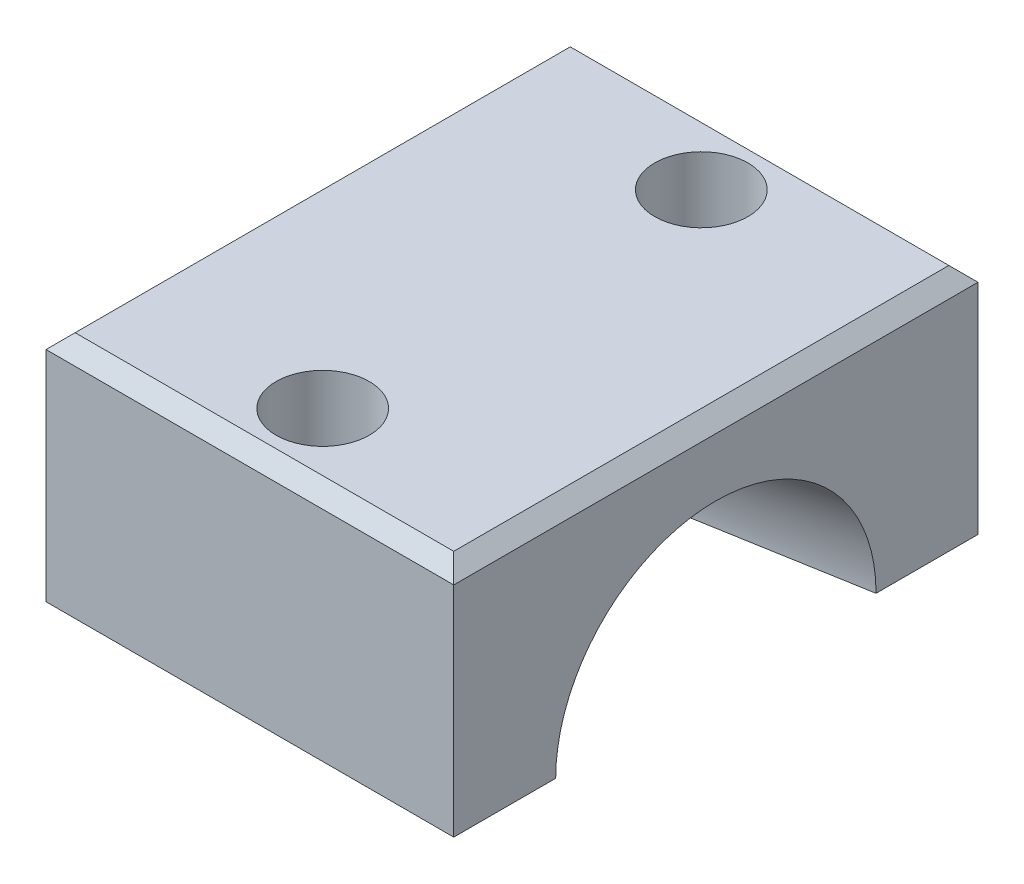
ISO-10303-21;
HEADER;
FILE_DESCRIPTION(('STEP AP214'),'2;1');
FILE_NAME('part.step','',(''),(''),'','','');
FILE_SCHEMA(('AUTOMOTIVE_DESIGN { 1 0 10303 214 1 1 1 1 }'));
ENDSEC;
DATA;
#1=APPLICATION_CONTEXT('core data for automotive mechanical design processes');
#2=APPLICATION_PROTOCOL_DEFINITION('international standard','automotive_design',2000,#1);
#3=PRODUCT_CONTEXT('',#1,'mechanical');
#4=PRODUCT('Part','Part','',(#3));
#5=PRODUCT_RELATED_PRODUCT_CATEGORY('part','',(#4));
#6=PRODUCT_DEFINITION_FORMATION('','',#4);
#7=PRODUCT_DEFINITION_CONTEXT('part definition',#1,'design');
#8=PRODUCT_DEFINITION('design','',#6,#7);
#9=PRODUCT_DEFINITION_SHAPE('','',#8);
#10=(LENGTH_UNIT() NAMED_UNIT(*) SI_UNIT(.MILLI.,.METRE.));
#11=(NAMED_UNIT(*) PLANE_ANGLE_UNIT() SI_UNIT($,.RADIAN.));
#12=(NAMED_UNIT(*) SI_UNIT($,.STERADIAN.) SOLID_ANGLE_UNIT());
#13=UNCERTAINTY_MEASURE_WITH_UNIT(LENGTH_MEASURE(1.E-05),#10,'distance_accuracy_value','');
#14=(GEOMETRIC_REPRESENTATION_CONTEXT(3) GLOBAL_UNCERTAINTY_ASSIGNED_CONTEXT((#13)) GLOBAL_UNIT_ASSIGNED_CONTEXT((#10,
#11,#12)) REPRESENTATION_CONTEXT('',''));
#15=CARTESIAN_POINT('',(0.,0.,0.));
#16=DIRECTION('',(0.,0.,1.));
#17=DIRECTION('',(1.,0.,0.));
#18=AXIS2_PLACEMENT_3D('',#15,#16,#17);
#19=CARTESIAN_POINT('',(0.,-4.,0.));
#20=DIRECTION('',(0.,-1.,0.));
#21=DIRECTION('',(0.,0.,-1.));
#22=AXIS2_PLACEMENT_3D('',#19,#20,#21);
#23=PLANE('',#22);
#24=DIRECTION('',(0.985211754819674,0.,-0.171341174751248));
#25=VECTOR('',#24,1.);
#26=CARTESIAN_POINT('',(-24.625,-4.,0.));
#27=LINE('',#26,#25);
#28=CARTESIAN_POINT('',(-4.5,-4.,-3.5));
#29=VERTEX_POINT('',#28);
#30=CARTESIAN_POINT('',(7.,-4.,-5.5));
#31=VERTEX_POINT('',#30);
#32=EDGE_CURVE('E113',#29,#31,#27,.T.);
#33=ORIENTED_EDGE('',*,*,#32,.F.);
#34=DIRECTION('',(-1.,0.,0.));
#35=VECTOR('',#34,1.);
#36=CARTESIAN_POINT('',(-4.5,-4.,-3.5));
#37=LINE('',#36,#35);
#38=CARTESIAN_POINT('',(-7.,-4.,-3.5));
#39=VERTEX_POINT('',#38);
#40=EDGE_CURVE('E290',#39,#29,#37,.F.);
#41=ORIENTED_EDGE('',*,*,#40,.F.);
#42=DIRECTION('',(0.,0.,1.));
#43=VECTOR('',#42,1.);
#44=CARTESIAN_POINT('',(-7.,-4.,9.));
#45=LINE('',#44,#43);
#46=CARTESIAN_POINT('',(-7.,-4.,-9.));
#47=VERTEX_POINT('',#46);
#48=EDGE_CURVE('E163',#47,#39,#45,.T.);
#49=ORIENTED_EDGE('',*,*,#48,.F.);
#50=DIRECTION('',(-1.,0.,0.));
#51=VECTOR('',#50,1.);
#52=CARTESIAN_POINT('',(-7.,-4.,-9.));
#53=LINE('',#52,#51);
#54=CARTESIAN_POINT('',(7.,-4.,-9.));
#55=VERTEX_POINT('',#54);
#56=EDGE_CURVE('E141',#55,#47,#53,.T.);
#57=ORIENTED_EDGE('',*,*,#56,.F.);
#58=DIRECTION('',(0.,0.,-1.));
#59=VECTOR('',#58,1.);
#60=CARTESIAN_POINT('',(7.,-4.,9.));
#61=LINE('',#60,#59);
#62=EDGE_CURVE('E132',#31,#55,#61,.T.);
#63=ORIENTED_EDGE('',*,*,#62,.F.);
#64=EDGE_LOOP('',(#33,#41,#49,#57,#63));
#65=FACE_BOUND('',#64,.T.);
#66=CARTESIAN_POINT('',(0.,-4.,-6.5));
#67=DIRECTION('',(0.,1.,0.));
#68=DIRECTION('',(0.,0.,1.));
#69=AXIS2_PLACEMENT_3D('',#66,#67,#68);
#70=CIRCLE('',#69,1.6);
#71=CARTESIAN_POINT('',(0.,-4.,-4.9));
#72=VERTEX_POINT('',#71);
#73=EDGE_CURVE('E149',#72,#72,#70,.T.);
#74=ORIENTED_EDGE('',*,*,#73,.T.);
#75=EDGE_LOOP('',(#74));
#76=FACE_BOUND('',#75,.T.);
#77=ADVANCED_FACE('F41',(#65,#76),#23,.T.);
#78=CARTESIAN_POINT('',(0.,4.,0.));
#79=DIRECTION('',(0.,-1.,0.));
#80=DIRECTION('',(0.,0.,-1.));
#81=AXIS2_PLACEMENT_3D('',#78,#79,#80);
#82=PLANE('',#81);
#83=DIRECTION('',(0.,0.,-1.));
#84=VECTOR('',#83,1.);
#85=CARTESIAN_POINT('',(6.5,4.,0.));
#86=LINE('',#85,#84);
#87=CARTESIAN_POINT('',(6.5,4.,8.5));
#88=VERTEX_POINT('',#87);
#89=CARTESIAN_POINT('',(6.5,4.,-8.5));
#90=VERTEX_POINT('',#89);
#91=EDGE_CURVE('E192',#88,#90,#86,.T.);
#92=ORIENTED_EDGE('',*,*,#91,.T.);
#93=DIRECTION('',(-1.,0.,0.));
#94=VECTOR('',#93,1.);
#95=CARTESIAN_POINT('',(0.,4.,-8.5));
#96=LINE('',#95,#94);
#97=CARTESIAN_POINT('',(-6.5,4.,-8.5));
#98=VERTEX_POINT('',#97);
#99=EDGE_CURVE('E199',#90,#98,#96,.T.);
#100=ORIENTED_EDGE('',*,*,#99,.T.);
#101=DIRECTION('',(0.,0.,1.));
#102=VECTOR('',#101,1.);
#103=CARTESIAN_POINT('',(-6.5,4.,0.));
#104=LINE('',#103,#102);
#105=CARTESIAN_POINT('',(-6.5,4.,8.5));
#106=VERTEX_POINT('',#105);
#107=EDGE_CURVE('E181',#98,#106,#104,.T.);
#108=ORIENTED_EDGE('',*,*,#107,.T.);
#109=DIRECTION('',(1.,0.,0.));
#110=VECTOR('',#109,1.);
#111=CARTESIAN_POINT('',(0.,4.,8.5));
#112=LINE('',#111,#110);
#113=EDGE_CURVE('E185',#106,#88,#112,.T.);
#114=ORIENTED_EDGE('',*,*,#113,.T.);
#115=EDGE_LOOP('',(#92,#100,#108,#114));
#116=FACE_BOUND('',#115,.T.);
#117=CARTESIAN_POINT('',(0.,4.,-6.5));
#118=DIRECTION('',(0.,1.,0.));
#119=DIRECTION('',(0.,0.,1.));
#120=AXIS2_PLACEMENT_3D('',#117,#118,#119);
#121=CIRCLE('',#120,1.6);
#122=CARTESIAN_POINT('',(0.,4.,-4.9));
#123=VERTEX_POINT('',#122);
#124=EDGE_CURVE('E143',#123,#123,#121,.T.);
#125=ORIENTED_EDGE('',*,*,#124,.F.);
#126=EDGE_LOOP('',(#125));
#127=FACE_BOUND('',#126,.T.);
#128=CARTESIAN_POINT('',(0.,4.,6.5));
#129=DIRECTION('',(0.,1.,0.));
#130=DIRECTION('',(0.,0.,1.));
#131=AXIS2_PLACEMENT_3D('',#128,#129,#130);
#132=CIRCLE('',#131,1.6);
#133=CARTESIAN_POINT('',(0.,4.,8.1));
#134=VERTEX_POINT('',#133);
#135=EDGE_CURVE('E248',#134,#134,#132,.T.);
#136=ORIENTED_EDGE('',*,*,#135,.F.);
#137=EDGE_LOOP('',(#136));
#138=FACE_BOUND('',#137,.T.);
#139=ADVANCED_FACE('F239',(#116,#127,#138),#82,.F.);
#140=DIRECTION('',(-0.985211754819674,0.,-0.171341174751248));
#141=VECTOR('',#140,1.);
#142=CARTESIAN_POINT('',(-24.625,-4.,0.));
#143=LINE('',#142,#141);
#144=CARTESIAN_POINT('',(7.,-4.,5.5));
#145=VERTEX_POINT('',#144);
#146=CARTESIAN_POINT('',(-4.5,-4.,3.5));
#147=VERTEX_POINT('',#146);
#148=EDGE_CURVE('E127',#145,#147,#143,.T.);
#149=ORIENTED_EDGE('',*,*,#148,.F.);
#150=CARTESIAN_POINT('',(7.,-4.,9.));
#151=VERTEX_POINT('',#150);
#152=EDGE_CURVE('E135',#151,#145,#61,.T.);
#153=ORIENTED_EDGE('',*,*,#152,.F.);
#154=DIRECTION('',(1.,0.,0.));
#155=VECTOR('',#154,1.);
#156=CARTESIAN_POINT('',(-7.,-4.,9.));
#157=LINE('',#156,#155);
#158=CARTESIAN_POINT('',(-7.,-4.,9.));
#159=VERTEX_POINT('',#158);
#160=EDGE_CURVE('E167',#159,#151,#157,.T.);
#161=ORIENTED_EDGE('',*,*,#160,.F.);
#162=CARTESIAN_POINT('',(-7.,-4.,3.5));
#163=VERTEX_POINT('',#162);
#164=EDGE_CURVE('E162',#163,#159,#45,.T.);
#165=ORIENTED_EDGE('',*,*,#164,.F.);
#166=DIRECTION('',(-1.,0.,0.));
#167=VECTOR('',#166,1.);
#168=CARTESIAN_POINT('',(-4.5,-4.,3.5));
#169=LINE('',#168,#167);
#170=EDGE_CURVE('E154',#147,#163,#169,.T.);
#171=ORIENTED_EDGE('',*,*,#170,.F.);
#172=EDGE_LOOP('',(#149,#153,#161,#165,#171));
#173=FACE_BOUND('',#172,.T.);
#174=CARTESIAN_POINT('',(0.,-4.,6.5));
#175=DIRECTION('',(0.,1.,0.));
#176=DIRECTION('',(0.,0.,1.));
#177=AXIS2_PLACEMENT_3D('',#174,#175,#176);
#178=CIRCLE('',#177,1.6);
#179=CARTESIAN_POINT('',(0.,-4.,8.1));
#180=VERTEX_POINT('',#179);
#181=EDGE_CURVE('E251',#180,#180,#178,.T.);
#182=ORIENTED_EDGE('',*,*,#181,.T.);
#183=EDGE_LOOP('',(#182));
#184=FACE_BOUND('',#183,.T.);
#185=ADVANCED_FACE('F242',(#173,#184),#23,.T.);
#186=CARTESIAN_POINT('',(7.,4.,9.));
#187=DIRECTION('',(-1.,0.,0.));
#188=DIRECTION('',(0.,0.,1.));
#189=AXIS2_PLACEMENT_3D('',#186,#187,#188);
#190=PLANE('',#189);
#191=DIRECTION('',(0.,-1.,0.));
#192=VECTOR('',#191,1.);
#193=CARTESIAN_POINT('',(7.,4.,-9.));
#194=LINE('',#193,#192);
#195=CARTESIAN_POINT('',(7.,3.5,-9.));
#196=VERTEX_POINT('',#195);
#197=EDGE_CURVE('E179',#196,#55,#194,.T.);
#198=ORIENTED_EDGE('',*,*,#197,.F.);
#199=DIRECTION('',(0.,0.,1.));
#200=VECTOR('',#199,1.);
#201=CARTESIAN_POINT('',(7.,3.5,9.));
#202=LINE('',#201,#200);
#203=CARTESIAN_POINT('',(7.,3.5,9.));
#204=VERTEX_POINT('',#203);
#205=EDGE_CURVE('E66',#196,#204,#202,.T.);
#206=ORIENTED_EDGE('',*,*,#205,.T.);
#207=DIRECTION('',(0.,-1.,0.));
#208=VECTOR('',#207,1.);
#209=CARTESIAN_POINT('',(7.,4.,9.));
#210=LINE('',#209,#208);
#211=EDGE_CURVE('E171',#204,#151,#210,.T.);
#212=ORIENTED_EDGE('',*,*,#211,.T.);
#213=ORIENTED_EDGE('',*,*,#152,.T.);
#214=CARTESIAN_POINT('',(7.,-4.,0.));
#215=DIRECTION('',(1.,0.,0.));
#216=DIRECTION('',(0.,0.,-1.));
#217=AXIS2_PLACEMENT_3D('',#214,#215,#216);
#218=CIRCLE('',#217,5.5);
#219=EDGE_CURVE('E116',#31,#145,#218,.T.);
#220=ORIENTED_EDGE('',*,*,#219,.F.);
#221=ORIENTED_EDGE('',*,*,#62,.T.);
#222=EDGE_LOOP('',(#198,#206,#212,#213,#220,#221));
#223=FACE_BOUND('',#222,.T.);
#224=ADVANCED_FACE('F131',(#223),#190,.F.);
#225=CARTESIAN_POINT('',(-7.,4.,-9.));
#226=DIRECTION('',(0.,0.,1.));
#227=DIRECTION('',(1.,0.,0.));
#228=AXIS2_PLACEMENT_3D('',#225,#226,#227);
#229=PLANE('',#228);
#230=DIRECTION('',(0.,-1.,0.));
#231=VECTOR('',#230,1.);
#232=CARTESIAN_POINT('',(-7.,4.,-9.));
#233=LINE('',#232,#231);
#234=CARTESIAN_POINT('',(-7.,3.5,-9.));
#235=VERTEX_POINT('',#234);
#236=EDGE_CURVE('E177',#235,#47,#233,.T.);
#237=ORIENTED_EDGE('',*,*,#236,.F.);
#238=DIRECTION('',(1.,0.,0.));
#239=VECTOR('',#238,1.);
#240=CARTESIAN_POINT('',(-7.,3.5,-9.));
#241=LINE('',#240,#239);
#242=EDGE_CURVE('E202',#235,#196,#241,.T.);
#243=ORIENTED_EDGE('',*,*,#242,.T.);
#244=ORIENTED_EDGE('',*,*,#197,.T.);
#245=ORIENTED_EDGE('',*,*,#56,.T.);
#246=EDGE_LOOP('',(#237,#243,#244,#245));
#247=FACE_BOUND('',#246,.T.);
#248=ADVANCED_FACE('F235',(#247),#229,.F.);
#249=CARTESIAN_POINT('',(-7.,4.,9.));
#250=DIRECTION('',(1.,0.,0.));
#251=DIRECTION('',(0.,0.,-1.));
#252=AXIS2_PLACEMENT_3D('',#249,#250,#251);
#253=PLANE('',#252);
#254=DIRECTION('',(0.,-1.,0.));
#255=VECTOR('',#254,1.);
#256=CARTESIAN_POINT('',(-7.,4.,9.));
#257=LINE('',#256,#255);
#258=CARTESIAN_POINT('',(-7.,3.5,9.));
#259=VERTEX_POINT('',#258);
#260=EDGE_CURVE('E174',#259,#159,#257,.T.);
#261=ORIENTED_EDGE('',*,*,#260,.F.);
#262=DIRECTION('',(0.,0.,-1.));
#263=VECTOR('',#262,1.);
#264=CARTESIAN_POINT('',(-7.,3.5,9.));
#265=LINE('',#264,#263);
#266=EDGE_CURVE('E12',#259,#235,#265,.T.);
#267=ORIENTED_EDGE('',*,*,#266,.T.);
#268=ORIENTED_EDGE('',*,*,#236,.T.);
#269=ORIENTED_EDGE('',*,*,#48,.T.);
#270=CARTESIAN_POINT('',(-7.,-4.,0.));
#271=DIRECTION('',(-1.,0.,0.));
#272=DIRECTION('',(0.,0.,1.));
#273=AXIS2_PLACEMENT_3D('',#270,#271,#272);
#274=CIRCLE('',#273,3.5);
#275=EDGE_CURVE('E126',#163,#39,#274,.T.);
#276=ORIENTED_EDGE('',*,*,#275,.F.);
#277=ORIENTED_EDGE('',*,*,#164,.T.);
#278=EDGE_LOOP('',(#261,#267,#268,#269,#276,#277));
#279=FACE_BOUND('',#278,.T.);
#280=ADVANCED_FACE('F232',(#279),#253,.F.);
#281=CARTESIAN_POINT('',(-7.,4.,9.));
#282=DIRECTION('',(0.,0.,-1.));
#283=DIRECTION('',(-1.,0.,0.));
#284=AXIS2_PLACEMENT_3D('',#281,#282,#283);
#285=PLANE('',#284);
#286=ORIENTED_EDGE('',*,*,#211,.F.);
#287=DIRECTION('',(-1.,0.,0.));
#288=VECTOR('',#287,1.);
#289=CARTESIAN_POINT('',(-7.,3.5,9.));
#290=LINE('',#289,#288);
#291=EDGE_CURVE('E51',#204,#259,#290,.T.);
#292=ORIENTED_EDGE('',*,*,#291,.T.);
#293=ORIENTED_EDGE('',*,*,#260,.T.);
#294=ORIENTED_EDGE('',*,*,#160,.T.);
#295=EDGE_LOOP('',(#286,#292,#293,#294));
#296=FACE_BOUND('',#295,.T.);
#297=ADVANCED_FACE('F308',(#296),#285,.F.);
#298=CARTESIAN_POINT('',(0.,4.,-6.5));
#299=DIRECTION('',(0.,-1.,0.));
#300=DIRECTION('',(0.,0.,-1.));
#301=AXIS2_PLACEMENT_3D('',#298,#299,#300);
#302=CYLINDRICAL_SURFACE('',#301,1.6);
#303=ORIENTED_EDGE('',*,*,#124,.T.);
#304=EDGE_LOOP('',(#303));
#305=FACE_BOUND('',#304,.T.);
#306=ORIENTED_EDGE('',*,*,#73,.F.);
#307=EDGE_LOOP('',(#306));
#308=FACE_BOUND('',#307,.T.);
#309=ADVANCED_FACE('F310',(#305,#308),#302,.F.);
#310=CARTESIAN_POINT('',(0.,4.,6.5));
#311=DIRECTION('',(0.,-1.,0.));
#312=DIRECTION('',(0.,0.,-1.));
#313=AXIS2_PLACEMENT_3D('',#310,#311,#312);
#314=CYLINDRICAL_SURFACE('',#313,1.6);
#315=ORIENTED_EDGE('',*,*,#135,.T.);
#316=EDGE_LOOP('',(#315));
#317=FACE_BOUND('',#316,.T.);
#318=ORIENTED_EDGE('',*,*,#181,.F.);
#319=EDGE_LOOP('',(#318));
#320=FACE_BOUND('',#319,.T.);
#321=ADVANCED_FACE('F282',(#317,#320),#314,.F.);
#322=CARTESIAN_POINT('',(-4.5,-4.,0.));
#323=DIRECTION('',(-1.,0.,0.));
#324=DIRECTION('',(0.,0.,1.));
#325=AXIS2_PLACEMENT_3D('',#322,#323,#324);
#326=CYLINDRICAL_SURFACE('',#325,3.5);
#327=ORIENTED_EDGE('',*,*,#170,.T.);
#328=ORIENTED_EDGE('',*,*,#275,.T.);
#329=ORIENTED_EDGE('',*,*,#40,.T.);
#330=CARTESIAN_POINT('',(-4.5,-4.,0.));
#331=DIRECTION('',(-1.,0.,0.));
#332=DIRECTION('',(0.,0.,1.));
#333=AXIS2_PLACEMENT_3D('',#330,#331,#332);
#334=CIRCLE('',#333,3.5);
#335=EDGE_CURVE('E119',#147,#29,#334,.T.);
#336=ORIENTED_EDGE('',*,*,#335,.F.);
#337=EDGE_LOOP('',(#327,#328,#329,#336));
#338=FACE_BOUND('',#337,.T.);
#339=ADVANCED_FACE('F278',(#338),#326,.F.);
#340=CARTESIAN_POINT('',(-4.5,-4.,0.));
#341=DIRECTION('',(1.,0.,0.));
#342=DIRECTION('',(0.,0.,-1.));
#343=AXIS2_PLACEMENT_3D('',#340,#341,#342);
#344=CONICAL_SURFACE('',#343,3.5,0.172190814522939);
#345=ORIENTED_EDGE('',*,*,#32,.T.);
#346=ORIENTED_EDGE('',*,*,#219,.T.);
#347=ORIENTED_EDGE('',*,*,#148,.T.);
#348=ORIENTED_EDGE('',*,*,#335,.T.);
#349=EDGE_LOOP('',(#345,#346,#347,#348));
#350=FACE_BOUND('',#349,.T.);
#351=ADVANCED_FACE('F115',(#350),#344,.F.);
#352=CARTESIAN_POINT('',(0.,4.,8.5));
#353=DIRECTION('',(0.,-0.707106781186545,-0.70710678118655));
#354=DIRECTION('',(1.,0.,0.));
#355=AXIS2_PLACEMENT_3D('',#352,#353,#354);
#356=PLANE('',#355);
#357=DIRECTION('',(0.577350269189624,0.577350269189628,-0.577350269189624));
#358=VECTOR('',#357,1.);
#359=CARTESIAN_POINT('',(-3.66666666666668,6.83333333333334,5.66666666666668));
#360=LINE('',#359,#358);
#361=EDGE_CURVE('E214',#259,#106,#360,.T.);
#362=ORIENTED_EDGE('',*,*,#361,.F.);
#363=ORIENTED_EDGE('',*,*,#291,.F.);
#364=DIRECTION('',(-0.577350269189624,0.577350269189628,-0.577350269189624));
#365=VECTOR('',#364,1.);
#366=CARTESIAN_POINT('',(4.33333333333334,6.16666666666667,6.33333333333334));
#367=LINE('',#366,#365);
#368=EDGE_CURVE('E45',#88,#204,#367,.F.);
#369=ORIENTED_EDGE('',*,*,#368,.F.);
#370=ORIENTED_EDGE('',*,*,#113,.F.);
#371=EDGE_LOOP('',(#362,#363,#369,#370));
#372=FACE_BOUND('',#371,.T.);
#373=ADVANCED_FACE('F43',(#372),#356,.F.);
#374=CARTESIAN_POINT('',(6.5,4.,0.));
#375=DIRECTION('',(-0.70710678118655,-0.707106781186545,0.));
#376=DIRECTION('',(0.,0.,-1.));
#377=AXIS2_PLACEMENT_3D('',#374,#375,#376);
#378=PLANE('',#377);
#379=ORIENTED_EDGE('',*,*,#368,.T.);
#380=ORIENTED_EDGE('',*,*,#205,.F.);
#381=DIRECTION('',(-0.577350269189624,0.577350269189628,0.577350269189624));
#382=VECTOR('',#381,1.);
#383=CARTESIAN_POINT('',(3.66666666666668,6.83333333333334,-5.66666666666668));
#384=LINE('',#383,#382);
#385=EDGE_CURVE('E212',#90,#196,#384,.F.);
#386=ORIENTED_EDGE('',*,*,#385,.F.);
#387=ORIENTED_EDGE('',*,*,#91,.F.);
#388=EDGE_LOOP('',(#379,#380,#386,#387));
#389=FACE_BOUND('',#388,.T.);
#390=ADVANCED_FACE('F225',(#389),#378,.F.);
#391=CARTESIAN_POINT('',(-6.5,4.,0.));
#392=DIRECTION('',(0.70710678118655,-0.707106781186545,0.));
#393=DIRECTION('',(0.,0.,1.));
#394=AXIS2_PLACEMENT_3D('',#391,#392,#393);
#395=PLANE('',#394);
#396=ORIENTED_EDGE('',*,*,#361,.T.);
#397=ORIENTED_EDGE('',*,*,#107,.F.);
#398=DIRECTION('',(-0.577350269189624,-0.577350269189628,-0.577350269189624));
#399=VECTOR('',#398,1.);
#400=CARTESIAN_POINT('',(-3.66666666666668,6.83333333333334,-5.66666666666668));
#401=LINE('',#400,#399);
#402=EDGE_CURVE('E209',#235,#98,#401,.F.);
#403=ORIENTED_EDGE('',*,*,#402,.F.);
#404=ORIENTED_EDGE('',*,*,#266,.F.);
#405=EDGE_LOOP('',(#396,#397,#403,#404));
#406=FACE_BOUND('',#405,.T.);
#407=ADVANCED_FACE('F229',(#406),#395,.F.);
#408=CARTESIAN_POINT('',(0.,4.,-8.5));
#409=DIRECTION('',(0.,-0.707106781186545,0.70710678118655));
#410=DIRECTION('',(-1.,0.,0.));
#411=AXIS2_PLACEMENT_3D('',#408,#409,#410);
#412=PLANE('',#411);
#413=ORIENTED_EDGE('',*,*,#385,.T.);
#414=ORIENTED_EDGE('',*,*,#242,.F.);
#415=ORIENTED_EDGE('',*,*,#402,.T.);
#416=ORIENTED_EDGE('',*,*,#99,.F.);
#417=EDGE_LOOP('',(#413,#414,#415,#416));
#418=FACE_BOUND('',#417,.T.);
#419=ADVANCED_FACE('F237',(#418),#412,.F.);
#420=CLOSED_SHELL('',(#77,#139,#185,#224,#248,#280,#297,#309,#321,#339,#351,#373,#390,#407,#419));
#421=MANIFOLD_SOLID_BREP('B2',#420);
#422=ADVANCED_BREP_SHAPE_REPRESENTATION('',(#18,#421),#14);
#423=SHAPE_DEFINITION_REPRESENTATION(#9,#422);
ENDSEC;
END-ISO-10303-21;
